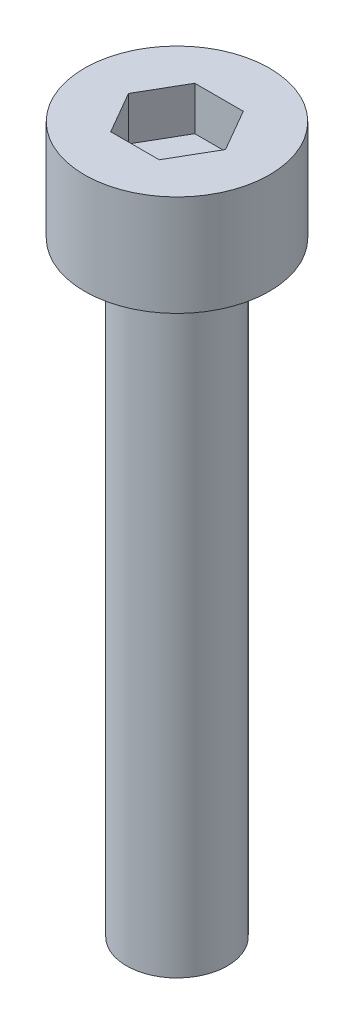
ISO-10303-21;
HEADER;
FILE_DESCRIPTION(('STEP AP214'),'2;1');
FILE_NAME('part.step','',(''),(''),'','','');
FILE_SCHEMA(('AUTOMOTIVE_DESIGN { 1 0 10303 214 1 1 1 1 }'));
ENDSEC;
DATA;
#1=APPLICATION_CONTEXT('core data for automotive mechanical design processes');
#2=APPLICATION_PROTOCOL_DEFINITION('international standard','automotive_design',2000,#1);
#3=PRODUCT_CONTEXT('',#1,'mechanical');
#4=PRODUCT('Part','Part','',(#3));
#5=PRODUCT_RELATED_PRODUCT_CATEGORY('part','',(#4));
#6=PRODUCT_DEFINITION_FORMATION('','',#4);
#7=PRODUCT_DEFINITION_CONTEXT('part definition',#1,'design');
#8=PRODUCT_DEFINITION('design','',#6,#7);
#9=PRODUCT_DEFINITION_SHAPE('','',#8);
#10=(LENGTH_UNIT() NAMED_UNIT(*) SI_UNIT(.MILLI.,.METRE.));
#11=(NAMED_UNIT(*) PLANE_ANGLE_UNIT() SI_UNIT($,.RADIAN.));
#12=(NAMED_UNIT(*) SI_UNIT($,.STERADIAN.) SOLID_ANGLE_UNIT());
#13=UNCERTAINTY_MEASURE_WITH_UNIT(LENGTH_MEASURE(1.E-05),#10,'distance_accuracy_value','');
#14=(GEOMETRIC_REPRESENTATION_CONTEXT(3) GLOBAL_UNCERTAINTY_ASSIGNED_CONTEXT((#13)) GLOBAL_UNIT_ASSIGNED_CONTEXT((#10,
#11,#12)) REPRESENTATION_CONTEXT('',''));
#15=CARTESIAN_POINT('',(0.,0.,0.));
#16=DIRECTION('',(0.,0.,1.));
#17=DIRECTION('',(1.,0.,0.));
#18=AXIS2_PLACEMENT_3D('',#15,#16,#17);
#19=CARTESIAN_POINT('',(0.,3.,0.));
#20=DIRECTION('',(0.,-1.,0.));
#21=DIRECTION('',(0.,0.,-1.));
#22=AXIS2_PLACEMENT_3D('',#19,#20,#21);
#23=CYLINDRICAL_SURFACE('',#22,2.75);
#24=CARTESIAN_POINT('',(0.,3.,0.));
#25=DIRECTION('',(0.,1.,0.));
#26=DIRECTION('',(0.,0.,1.));
#27=AXIS2_PLACEMENT_3D('',#24,#25,#26);
#28=CIRCLE('',#27,2.75);
#29=CARTESIAN_POINT('',(0.,3.,2.75));
#30=VERTEX_POINT('',#29);
#31=EDGE_CURVE('E45',#30,#30,#28,.T.);
#32=ORIENTED_EDGE('',*,*,#31,.F.);
#33=EDGE_LOOP('',(#32));
#34=FACE_BOUND('',#33,.T.);
#35=CARTESIAN_POINT('',(0.,0.,0.));
#36=DIRECTION('',(0.,1.,0.));
#37=DIRECTION('',(0.,0.,1.));
#38=AXIS2_PLACEMENT_3D('',#35,#36,#37);
#39=CIRCLE('',#38,2.75);
#40=CARTESIAN_POINT('',(0.,0.,2.75));
#41=VERTEX_POINT('',#40);
#42=EDGE_CURVE('E40',#41,#41,#39,.T.);
#43=ORIENTED_EDGE('',*,*,#42,.T.);
#44=EDGE_LOOP('',(#43));
#45=FACE_BOUND('',#44,.T.);
#46=ADVANCED_FACE('F37',(#34,#45),#23,.T.);
#47=CARTESIAN_POINT('',(0.,3.,0.));
#48=DIRECTION('',(0.,1.,0.));
#49=DIRECTION('',(0.,0.,1.));
#50=AXIS2_PLACEMENT_3D('',#47,#48,#49);
#51=PLANE('',#50);
#52=DIRECTION('',(0.5,0.,-0.866025403784439));
#53=VECTOR('',#52,1.);
#54=CARTESIAN_POINT('',(0.721687836487032,3.,1.25));
#55=LINE('',#54,#53);
#56=CARTESIAN_POINT('',(0.721687836487032,3.,1.25));
#57=VERTEX_POINT('',#56);
#58=CARTESIAN_POINT('',(1.44337567297406,3.,0.));
#59=VERTEX_POINT('',#58);
#60=EDGE_CURVE('E53',#57,#59,#55,.T.);
#61=ORIENTED_EDGE('',*,*,#60,.F.);
#62=DIRECTION('',(1.,0.,0.));
#63=VECTOR('',#62,1.);
#64=CARTESIAN_POINT('',(-0.721687836487033,3.,1.25));
#65=LINE('',#64,#63);
#66=CARTESIAN_POINT('',(-0.721687836487033,3.,1.25));
#67=VERTEX_POINT('',#66);
#68=EDGE_CURVE('E137',#67,#57,#65,.T.);
#69=ORIENTED_EDGE('',*,*,#68,.F.);
#70=DIRECTION('',(0.5,0.,0.866025403784439));
#71=VECTOR('',#70,1.);
#72=CARTESIAN_POINT('',(-1.44337567297407,3.,0.));
#73=LINE('',#72,#71);
#74=CARTESIAN_POINT('',(-1.44337567297407,3.,0.));
#75=VERTEX_POINT('',#74);
#76=EDGE_CURVE('E135',#75,#67,#73,.T.);
#77=ORIENTED_EDGE('',*,*,#76,.F.);
#78=DIRECTION('',(-0.5,0.,0.866025403784438));
#79=VECTOR('',#78,1.);
#80=CARTESIAN_POINT('',(-0.721687836487033,3.,-1.25));
#81=LINE('',#80,#79);
#82=CARTESIAN_POINT('',(-0.721687836487033,3.,-1.25));
#83=VERTEX_POINT('',#82);
#84=EDGE_CURVE('E101',#83,#75,#81,.T.);
#85=ORIENTED_EDGE('',*,*,#84,.F.);
#86=DIRECTION('',(-1.,0.,0.));
#87=VECTOR('',#86,1.);
#88=CARTESIAN_POINT('',(0.721687836487032,3.,-1.25));
#89=LINE('',#88,#87);
#90=CARTESIAN_POINT('',(0.721687836487032,3.,-1.25));
#91=VERTEX_POINT('',#90);
#92=EDGE_CURVE('E131',#91,#83,#89,.T.);
#93=ORIENTED_EDGE('',*,*,#92,.F.);
#94=DIRECTION('',(-0.5,0.,-0.866025403784439));
#95=VECTOR('',#94,1.);
#96=CARTESIAN_POINT('',(1.44337567297406,3.,0.));
#97=LINE('',#96,#95);
#98=EDGE_CURVE('E127',#59,#91,#97,.T.);
#99=ORIENTED_EDGE('',*,*,#98,.F.);
#100=EDGE_LOOP('',(#61,#69,#77,#85,#93,#99));
#101=FACE_BOUND('',#100,.T.);
#102=ORIENTED_EDGE('',*,*,#31,.T.);
#103=EDGE_LOOP('',(#102));
#104=FACE_BOUND('',#103,.T.);
#105=ADVANCED_FACE('F155',(#101,#104),#51,.T.);
#106=CARTESIAN_POINT('',(0.,0.,0.));
#107=DIRECTION('',(0.,1.,0.));
#108=DIRECTION('',(0.,0.,1.));
#109=AXIS2_PLACEMENT_3D('',#106,#107,#108);
#110=PLANE('',#109);
#111=CARTESIAN_POINT('',(0.,0.,0.));
#112=DIRECTION('',(0.,-1.,0.));
#113=DIRECTION('',(0.,0.,-1.));
#114=AXIS2_PLACEMENT_3D('',#111,#112,#113);
#115=CIRCLE('',#114,1.5);
#116=CARTESIAN_POINT('',(0.,0.,-1.5));
#117=VERTEX_POINT('',#116);
#118=EDGE_CURVE('E11',#117,#117,#115,.T.);
#119=ORIENTED_EDGE('',*,*,#118,.F.);
#120=EDGE_LOOP('',(#119));
#121=FACE_BOUND('',#120,.T.);
#122=ORIENTED_EDGE('',*,*,#42,.F.);
#123=EDGE_LOOP('',(#122));
#124=FACE_BOUND('',#123,.T.);
#125=ADVANCED_FACE('F152',(#121,#124),#110,.F.);
#126=CARTESIAN_POINT('',(0.721687836487032,1.7,1.25));
#127=DIRECTION('',(0.866025403784439,0.,0.5));
#128=DIRECTION('',(0.5,0.,-0.866025403784439));
#129=AXIS2_PLACEMENT_3D('',#126,#127,#128);
#130=PLANE('',#129);
#131=ORIENTED_EDGE('',*,*,#60,.T.);
#132=DIRECTION('',(0.,1.,0.));
#133=VECTOR('',#132,1.);
#134=CARTESIAN_POINT('',(1.44337567297406,1.7,0.));
#135=LINE('',#134,#133);
#136=CARTESIAN_POINT('',(1.44337567297406,1.7,0.));
#137=VERTEX_POINT('',#136);
#138=EDGE_CURVE('E83',#137,#59,#135,.T.);
#139=ORIENTED_EDGE('',*,*,#138,.F.);
#140=DIRECTION('',(0.5,0.,-0.866025403784439));
#141=VECTOR('',#140,1.);
#142=CARTESIAN_POINT('',(0.721687836487032,1.7,1.25));
#143=LINE('',#142,#141);
#144=CARTESIAN_POINT('',(0.721687836487032,1.7,1.25));
#145=VERTEX_POINT('',#144);
#146=EDGE_CURVE('E139',#145,#137,#143,.T.);
#147=ORIENTED_EDGE('',*,*,#146,.F.);
#148=DIRECTION('',(0.,1.,0.));
#149=VECTOR('',#148,1.);
#150=CARTESIAN_POINT('',(0.721687836487032,1.7,1.25));
#151=LINE('',#150,#149);
#152=EDGE_CURVE('E61',#145,#57,#151,.T.);
#153=ORIENTED_EDGE('',*,*,#152,.T.);
#154=EDGE_LOOP('',(#131,#139,#147,#153));
#155=FACE_BOUND('',#154,.T.);
#156=ADVANCED_FACE('F154',(#155),#130,.F.);
#157=CARTESIAN_POINT('',(-0.721687836487033,1.7,1.25));
#158=DIRECTION('',(0.,0.,1.));
#159=DIRECTION('',(1.,0.,0.));
#160=AXIS2_PLACEMENT_3D('',#157,#158,#159);
#161=PLANE('',#160);
#162=ORIENTED_EDGE('',*,*,#68,.T.);
#163=ORIENTED_EDGE('',*,*,#152,.F.);
#164=DIRECTION('',(1.,0.,0.));
#165=VECTOR('',#164,1.);
#166=CARTESIAN_POINT('',(-0.721687836487033,1.7,1.25));
#167=LINE('',#166,#165);
#168=CARTESIAN_POINT('',(-0.721687836487033,1.7,1.25));
#169=VERTEX_POINT('',#168);
#170=EDGE_CURVE('E113',#169,#145,#167,.T.);
#171=ORIENTED_EDGE('',*,*,#170,.F.);
#172=DIRECTION('',(0.,1.,0.));
#173=VECTOR('',#172,1.);
#174=CARTESIAN_POINT('',(-0.721687836487033,1.7,1.25));
#175=LINE('',#174,#173);
#176=EDGE_CURVE('E105',#169,#67,#175,.T.);
#177=ORIENTED_EDGE('',*,*,#176,.T.);
#178=EDGE_LOOP('',(#162,#163,#171,#177));
#179=FACE_BOUND('',#178,.T.);
#180=ADVANCED_FACE('F161',(#179),#161,.F.);
#181=CARTESIAN_POINT('',(-1.44337567297407,1.7,0.));
#182=DIRECTION('',(-0.866025403784439,0.,0.5));
#183=DIRECTION('',(0.5,0.,0.866025403784439));
#184=AXIS2_PLACEMENT_3D('',#181,#182,#183);
#185=PLANE('',#184);
#186=ORIENTED_EDGE('',*,*,#76,.T.);
#187=ORIENTED_EDGE('',*,*,#176,.F.);
#188=DIRECTION('',(0.5,0.,0.866025403784439));
#189=VECTOR('',#188,1.);
#190=CARTESIAN_POINT('',(-1.44337567297407,1.7,0.));
#191=LINE('',#190,#189);
#192=CARTESIAN_POINT('',(-1.44337567297407,1.7,0.));
#193=VERTEX_POINT('',#192);
#194=EDGE_CURVE('E109',#193,#169,#191,.T.);
#195=ORIENTED_EDGE('',*,*,#194,.F.);
#196=DIRECTION('',(0.,1.,0.));
#197=VECTOR('',#196,1.);
#198=CARTESIAN_POINT('',(-1.44337567297407,1.7,0.));
#199=LINE('',#198,#197);
#200=EDGE_CURVE('E94',#193,#75,#199,.T.);
#201=ORIENTED_EDGE('',*,*,#200,.T.);
#202=EDGE_LOOP('',(#186,#187,#195,#201));
#203=FACE_BOUND('',#202,.T.);
#204=ADVANCED_FACE('F110',(#203),#185,.F.);
#205=CARTESIAN_POINT('',(-0.721687836487033,1.7,-1.25));
#206=DIRECTION('',(-0.866025403784439,0.,-0.5));
#207=DIRECTION('',(-0.5,0.,0.866025403784439));
#208=AXIS2_PLACEMENT_3D('',#205,#206,#207);
#209=PLANE('',#208);
#210=ORIENTED_EDGE('',*,*,#84,.T.);
#211=ORIENTED_EDGE('',*,*,#200,.F.);
#212=DIRECTION('',(-0.5,0.,0.866025403784438));
#213=VECTOR('',#212,1.);
#214=CARTESIAN_POINT('',(-0.721687836487033,1.7,-1.25));
#215=LINE('',#214,#213);
#216=CARTESIAN_POINT('',(-0.721687836487033,1.7,-1.25));
#217=VERTEX_POINT('',#216);
#218=EDGE_CURVE('E98',#217,#193,#215,.T.);
#219=ORIENTED_EDGE('',*,*,#218,.F.);
#220=DIRECTION('',(0.,1.,0.));
#221=VECTOR('',#220,1.);
#222=CARTESIAN_POINT('',(-0.721687836487033,1.7,-1.25));
#223=LINE('',#222,#221);
#224=EDGE_CURVE('E106',#217,#83,#223,.T.);
#225=ORIENTED_EDGE('',*,*,#224,.T.);
#226=EDGE_LOOP('',(#210,#211,#219,#225));
#227=FACE_BOUND('',#226,.T.);
#228=ADVANCED_FACE('F96',(#227),#209,.F.);
#229=CARTESIAN_POINT('',(0.721687836487032,1.7,-1.25));
#230=DIRECTION('',(0.,0.,-1.));
#231=DIRECTION('',(-1.,0.,0.));
#232=AXIS2_PLACEMENT_3D('',#229,#230,#231);
#233=PLANE('',#232);
#234=ORIENTED_EDGE('',*,*,#92,.T.);
#235=ORIENTED_EDGE('',*,*,#224,.F.);
#236=DIRECTION('',(-1.,0.,0.));
#237=VECTOR('',#236,1.);
#238=CARTESIAN_POINT('',(0.721687836487032,1.7,-1.25));
#239=LINE('',#238,#237);
#240=CARTESIAN_POINT('',(0.721687836487032,1.7,-1.25));
#241=VERTEX_POINT('',#240);
#242=EDGE_CURVE('E119',#241,#217,#239,.T.);
#243=ORIENTED_EDGE('',*,*,#242,.F.);
#244=DIRECTION('',(0.,1.,0.));
#245=VECTOR('',#244,1.);
#246=CARTESIAN_POINT('',(0.721687836487032,1.7,-1.25));
#247=LINE('',#246,#245);
#248=EDGE_CURVE('E143',#241,#91,#247,.T.);
#249=ORIENTED_EDGE('',*,*,#248,.T.);
#250=EDGE_LOOP('',(#234,#235,#243,#249));
#251=FACE_BOUND('',#250,.T.);
#252=ADVANCED_FACE('F206',(#251),#233,.F.);
#253=CARTESIAN_POINT('',(1.44337567297406,1.7,0.));
#254=DIRECTION('',(0.866025403784439,0.,-0.5));
#255=DIRECTION('',(-0.5,0.,-0.866025403784439));
#256=AXIS2_PLACEMENT_3D('',#253,#254,#255);
#257=PLANE('',#256);
#258=ORIENTED_EDGE('',*,*,#98,.T.);
#259=ORIENTED_EDGE('',*,*,#248,.F.);
#260=DIRECTION('',(-0.5,0.,-0.866025403784439));
#261=VECTOR('',#260,1.);
#262=CARTESIAN_POINT('',(1.44337567297406,1.7,0.));
#263=LINE('',#262,#261);
#264=EDGE_CURVE('E121',#137,#241,#263,.T.);
#265=ORIENTED_EDGE('',*,*,#264,.F.);
#266=ORIENTED_EDGE('',*,*,#138,.T.);
#267=EDGE_LOOP('',(#258,#259,#265,#266));
#268=FACE_BOUND('',#267,.T.);
#269=ADVANCED_FACE('F215',(#268),#257,.F.);
#270=CARTESIAN_POINT('',(0.,1.7,0.));
#271=DIRECTION('',(0.,1.,0.));
#272=DIRECTION('',(0.,0.,1.));
#273=AXIS2_PLACEMENT_3D('',#270,#271,#272);
#274=PLANE('',#273);
#275=ORIENTED_EDGE('',*,*,#146,.T.);
#276=ORIENTED_EDGE('',*,*,#264,.T.);
#277=ORIENTED_EDGE('',*,*,#242,.T.);
#278=ORIENTED_EDGE('',*,*,#218,.T.);
#279=ORIENTED_EDGE('',*,*,#194,.T.);
#280=ORIENTED_EDGE('',*,*,#170,.T.);
#281=EDGE_LOOP('',(#275,#276,#277,#278,#279,#280));
#282=FACE_BOUND('',#281,.T.);
#283=ADVANCED_FACE('F116',(#282),#274,.T.);
#284=CARTESIAN_POINT('',(0.,-18.,0.));
#285=DIRECTION('',(0.,1.,0.));
#286=DIRECTION('',(0.,0.,1.));
#287=AXIS2_PLACEMENT_3D('',#284,#285,#286);
#288=CYLINDRICAL_SURFACE('',#287,1.5);
#289=CARTESIAN_POINT('',(0.,-18.,0.));
#290=DIRECTION('',(0.,-1.,0.));
#291=DIRECTION('',(0.,0.,-1.));
#292=AXIS2_PLACEMENT_3D('',#289,#290,#291);
#293=CIRCLE('',#292,1.5);
#294=CARTESIAN_POINT('',(0.,-18.,-1.5));
#295=VERTEX_POINT('',#294);
#296=EDGE_CURVE('E128',#295,#295,#293,.T.);
#297=ORIENTED_EDGE('',*,*,#296,.F.);
#298=EDGE_LOOP('',(#297));
#299=FACE_BOUND('',#298,.T.);
#300=ORIENTED_EDGE('',*,*,#118,.T.);
#301=EDGE_LOOP('',(#300));
#302=FACE_BOUND('',#301,.T.);
#303=ADVANCED_FACE('F233',(#299,#302),#288,.T.);
#304=CARTESIAN_POINT('',(0.,-18.,0.));
#305=DIRECTION('',(0.,-1.,0.));
#306=DIRECTION('',(0.,0.,-1.));
#307=AXIS2_PLACEMENT_3D('',#304,#305,#306);
#308=PLANE('',#307);
#309=ORIENTED_EDGE('',*,*,#296,.T.);
#310=EDGE_LOOP('',(#309));
#311=FACE_BOUND('',#310,.T.);
#312=ADVANCED_FACE('F247',(#311),#308,.T.);
#313=CLOSED_SHELL('',(#46,#105,#125,#156,#180,#204,#228,#252,#269,#283,#303,#312));
#314=MANIFOLD_SOLID_BREP('B2',#313);
#315=ADVANCED_BREP_SHAPE_REPRESENTATION('',(#18,#314),#14);
#316=SHAPE_DEFINITION_REPRESENTATION(#9,#315);
ENDSEC;
END-ISO-10303-21;
